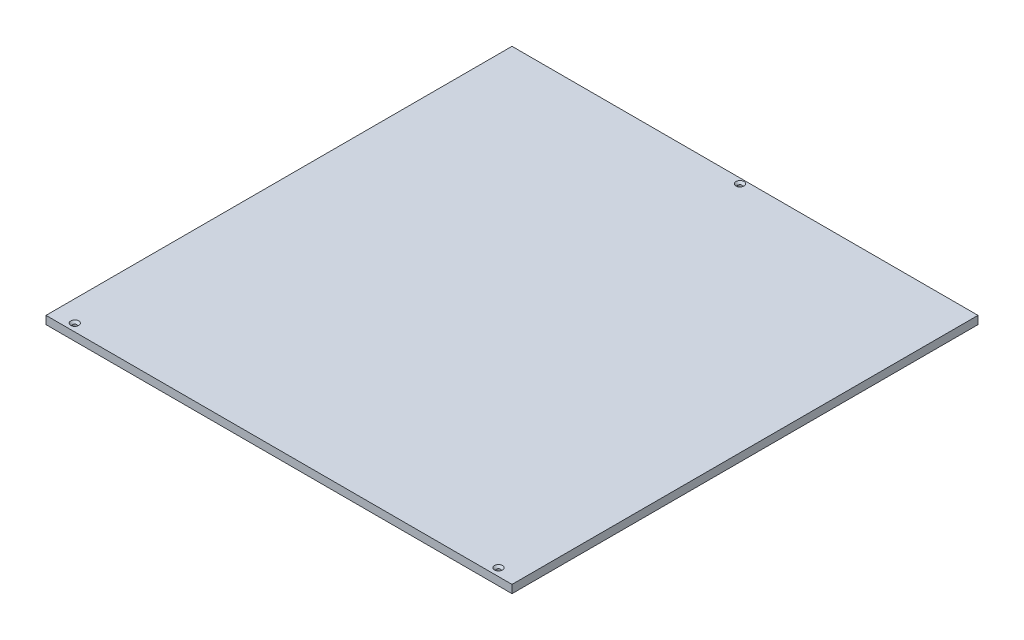
ISO-10303-21;
HEADER;
FILE_DESCRIPTION(('STEP AP214'),'2;1');
FILE_NAME('part.step','',(''),(''),'','','');
FILE_SCHEMA(('AUTOMOTIVE_DESIGN { 1 0 10303 214 1 1 1 1 }'));
ENDSEC;
DATA;
#1=APPLICATION_CONTEXT('core data for automotive mechanical design processes');
#2=APPLICATION_PROTOCOL_DEFINITION('international standard','automotive_design',2000,#1);
#3=PRODUCT_CONTEXT('',#1,'mechanical');
#4=PRODUCT('Part','Part','',(#3));
#5=PRODUCT_RELATED_PRODUCT_CATEGORY('part','',(#4));
#6=PRODUCT_DEFINITION_FORMATION('','',#4);
#7=PRODUCT_DEFINITION_CONTEXT('part definition',#1,'design');
#8=PRODUCT_DEFINITION('design','',#6,#7);
#9=PRODUCT_DEFINITION_SHAPE('','',#8);
#10=(LENGTH_UNIT() NAMED_UNIT(*) SI_UNIT(.MILLI.,.METRE.));
#11=(NAMED_UNIT(*) PLANE_ANGLE_UNIT() SI_UNIT($,.RADIAN.));
#12=(NAMED_UNIT(*) SI_UNIT($,.STERADIAN.) SOLID_ANGLE_UNIT());
#13=UNCERTAINTY_MEASURE_WITH_UNIT(LENGTH_MEASURE(1.E-05),#10,'distance_accuracy_value','');
#14=(GEOMETRIC_REPRESENTATION_CONTEXT(3) GLOBAL_UNCERTAINTY_ASSIGNED_CONTEXT((#13)) GLOBAL_UNIT_ASSIGNED_CONTEXT((#10,
#11,#12)) REPRESENTATION_CONTEXT('',''));
#15=CARTESIAN_POINT('',(0.,0.,0.));
#16=DIRECTION('',(0.,0.,1.));
#17=DIRECTION('',(1.,0.,0.));
#18=AXIS2_PLACEMENT_3D('',#15,#16,#17);
#19=CARTESIAN_POINT('',(0.,9.525,275.));
#20=DIRECTION('',(0.,0.,-1.));
#21=DIRECTION('',(-1.,0.,0.));
#22=AXIS2_PLACEMENT_3D('',#19,#20,#21);
#23=PLANE('',#22);
#24=DIRECTION('',(1.,0.,0.));
#25=VECTOR('',#24,1.);
#26=CARTESIAN_POINT('',(0.,0.,275.));
#27=LINE('',#26,#25);
#28=CARTESIAN_POINT('',(-275.,0.,275.));
#29=VERTEX_POINT('',#28);
#30=CARTESIAN_POINT('',(275.,0.,275.));
#31=VERTEX_POINT('',#30);
#32=EDGE_CURVE('E117',#29,#31,#27,.T.);
#33=ORIENTED_EDGE('',*,*,#32,.T.);
#34=DIRECTION('',(0.,-1.,0.));
#35=VECTOR('',#34,1.);
#36=CARTESIAN_POINT('',(275.,9.525,275.));
#37=LINE('',#36,#35);
#38=CARTESIAN_POINT('',(275.,9.525,275.));
#39=VERTEX_POINT('',#38);
#40=EDGE_CURVE('E11',#39,#31,#37,.T.);
#41=ORIENTED_EDGE('',*,*,#40,.F.);
#42=DIRECTION('',(1.,0.,0.));
#43=VECTOR('',#42,1.);
#44=CARTESIAN_POINT('',(0.,9.525,275.));
#45=LINE('',#44,#43);
#46=CARTESIAN_POINT('',(-275.,9.525,275.));
#47=VERTEX_POINT('',#46);
#48=EDGE_CURVE('E98',#47,#39,#45,.T.);
#49=ORIENTED_EDGE('',*,*,#48,.F.);
#50=DIRECTION('',(0.,-1.,0.));
#51=VECTOR('',#50,1.);
#52=CARTESIAN_POINT('',(-275.,9.525,275.));
#53=LINE('',#52,#51);
#54=EDGE_CURVE('E63',#47,#29,#53,.T.);
#55=ORIENTED_EDGE('',*,*,#54,.T.);
#56=EDGE_LOOP('',(#33,#41,#49,#55));
#57=FACE_BOUND('',#56,.T.);
#58=ADVANCED_FACE('F42',(#57),#23,.F.);
#59=CARTESIAN_POINT('',(275.,9.525,0.));
#60=DIRECTION('',(-1.,0.,0.));
#61=DIRECTION('',(0.,0.,1.));
#62=AXIS2_PLACEMENT_3D('',#59,#60,#61);
#63=PLANE('',#62);
#64=DIRECTION('',(0.,0.,-1.));
#65=VECTOR('',#64,1.);
#66=CARTESIAN_POINT('',(275.,0.,0.));
#67=LINE('',#66,#65);
#68=CARTESIAN_POINT('',(275.,0.,-275.));
#69=VERTEX_POINT('',#68);
#70=EDGE_CURVE('E104',#31,#69,#67,.T.);
#71=ORIENTED_EDGE('',*,*,#70,.T.);
#72=DIRECTION('',(0.,-1.,0.));
#73=VECTOR('',#72,1.);
#74=CARTESIAN_POINT('',(275.,9.525,-275.));
#75=LINE('',#74,#73);
#76=CARTESIAN_POINT('',(275.,9.525,-275.));
#77=VERTEX_POINT('',#76);
#78=EDGE_CURVE('E52',#77,#69,#75,.T.);
#79=ORIENTED_EDGE('',*,*,#78,.F.);
#80=DIRECTION('',(0.,0.,-1.));
#81=VECTOR('',#80,1.);
#82=CARTESIAN_POINT('',(275.,9.525,0.));
#83=LINE('',#82,#81);
#84=EDGE_CURVE('E90',#39,#77,#83,.T.);
#85=ORIENTED_EDGE('',*,*,#84,.F.);
#86=ORIENTED_EDGE('',*,*,#40,.T.);
#87=EDGE_LOOP('',(#71,#79,#85,#86));
#88=FACE_BOUND('',#87,.T.);
#89=ADVANCED_FACE('F103',(#88),#63,.F.);
#90=CARTESIAN_POINT('',(0.,9.525,-275.));
#91=DIRECTION('',(0.,0.,-1.));
#92=DIRECTION('',(-1.,0.,0.));
#93=AXIS2_PLACEMENT_3D('',#90,#91,#92);
#94=PLANE('',#93);
#95=DIRECTION('',(1.,0.,0.));
#96=VECTOR('',#95,1.);
#97=CARTESIAN_POINT('',(0.,0.,-275.));
#98=LINE('',#97,#96);
#99=CARTESIAN_POINT('',(-275.,0.,-275.));
#100=VERTEX_POINT('',#99);
#101=EDGE_CURVE('E123',#100,#69,#98,.T.);
#102=ORIENTED_EDGE('',*,*,#101,.F.);
#103=DIRECTION('',(0.,-1.,0.));
#104=VECTOR('',#103,1.);
#105=CARTESIAN_POINT('',(-275.,9.525,-275.));
#106=LINE('',#105,#104);
#107=CARTESIAN_POINT('',(-275.,9.525,-275.));
#108=VERTEX_POINT('',#107);
#109=EDGE_CURVE('E78',#108,#100,#106,.T.);
#110=ORIENTED_EDGE('',*,*,#109,.F.);
#111=DIRECTION('',(1.,0.,0.));
#112=VECTOR('',#111,1.);
#113=CARTESIAN_POINT('',(0.,9.525,-275.));
#114=LINE('',#113,#112);
#115=EDGE_CURVE('E97',#108,#77,#114,.T.);
#116=ORIENTED_EDGE('',*,*,#115,.T.);
#117=ORIENTED_EDGE('',*,*,#78,.T.);
#118=EDGE_LOOP('',(#102,#110,#116,#117));
#119=FACE_BOUND('',#118,.T.);
#120=ADVANCED_FACE('F109',(#119),#94,.T.);
#121=CARTESIAN_POINT('',(-275.,9.525,0.));
#122=DIRECTION('',(-1.,0.,0.));
#123=DIRECTION('',(0.,0.,1.));
#124=AXIS2_PLACEMENT_3D('',#121,#122,#123);
#125=PLANE('',#124);
#126=DIRECTION('',(0.,0.,-1.));
#127=VECTOR('',#126,1.);
#128=CARTESIAN_POINT('',(-275.,0.,0.));
#129=LINE('',#128,#127);
#130=EDGE_CURVE('E126',#29,#100,#129,.T.);
#131=ORIENTED_EDGE('',*,*,#130,.F.);
#132=ORIENTED_EDGE('',*,*,#54,.F.);
#133=DIRECTION('',(0.,0.,-1.));
#134=VECTOR('',#133,1.);
#135=CARTESIAN_POINT('',(-275.,9.525,0.));
#136=LINE('',#135,#134);
#137=EDGE_CURVE('E111',#47,#108,#136,.T.);
#138=ORIENTED_EDGE('',*,*,#137,.T.);
#139=ORIENTED_EDGE('',*,*,#109,.T.);
#140=EDGE_LOOP('',(#131,#132,#138,#139));
#141=FACE_BOUND('',#140,.T.);
#142=ADVANCED_FACE('F175',(#141),#125,.T.);
#143=CARTESIAN_POINT('',(0.,9.525,0.));
#144=DIRECTION('',(0.,1.,0.));
#145=DIRECTION('',(0.,0.,1.));
#146=AXIS2_PLACEMENT_3D('',#143,#144,#145);
#147=PLANE('',#146);
#148=CARTESIAN_POINT('',(0.,9.525,-268.997567297408));
#149=DIRECTION('',(0.,1.,0.));
#150=DIRECTION('',(0.,0.,1.));
#151=AXIS2_PLACEMENT_3D('',#148,#149,#150);
#152=CIRCLE('',#151,4.7);
#153=CARTESIAN_POINT('',(0.,9.525,-264.297567297408));
#154=VERTEX_POINT('',#153);
#155=EDGE_CURVE('E307',#154,#154,#152,.T.);
#156=ORIENTED_EDGE('',*,*,#155,.F.);
#157=EDGE_LOOP('',(#156));
#158=FACE_BOUND('',#157,.T.);
#159=CARTESIAN_POINT('',(250.,9.525,266.));
#160=DIRECTION('',(0.,1.,0.));
#161=DIRECTION('',(0.,0.,1.));
#162=AXIS2_PLACEMENT_3D('',#159,#160,#161);
#163=CIRCLE('',#162,4.69999999999998);
#164=CARTESIAN_POINT('',(250.,9.525,270.7));
#165=VERTEX_POINT('',#164);
#166=EDGE_CURVE('E149',#165,#165,#163,.T.);
#167=ORIENTED_EDGE('',*,*,#166,.F.);
#168=EDGE_LOOP('',(#167));
#169=FACE_BOUND('',#168,.T.);
#170=CARTESIAN_POINT('',(-250.,9.525,266.));
#171=DIRECTION('',(0.,1.,0.));
#172=DIRECTION('',(0.,0.,1.));
#173=AXIS2_PLACEMENT_3D('',#170,#171,#172);
#174=CIRCLE('',#173,4.70000000000001);
#175=CARTESIAN_POINT('',(-250.,9.525,270.7));
#176=VERTEX_POINT('',#175);
#177=EDGE_CURVE('E140',#176,#176,#174,.T.);
#178=ORIENTED_EDGE('',*,*,#177,.F.);
#179=EDGE_LOOP('',(#178));
#180=FACE_BOUND('',#179,.T.);
#181=ORIENTED_EDGE('',*,*,#48,.T.);
#182=ORIENTED_EDGE('',*,*,#84,.T.);
#183=ORIENTED_EDGE('',*,*,#115,.F.);
#184=ORIENTED_EDGE('',*,*,#137,.F.);
#185=EDGE_LOOP('',(#181,#182,#183,#184));
#186=FACE_BOUND('',#185,.T.);
#187=ADVANCED_FACE('F94',(#158,#169,#180,#186),#147,.T.);
#188=CARTESIAN_POINT('',(0.,0.,0.));
#189=DIRECTION('',(0.,1.,0.));
#190=DIRECTION('',(0.,0.,1.));
#191=AXIS2_PLACEMENT_3D('',#188,#189,#190);
#192=PLANE('',#191);
#193=CARTESIAN_POINT('',(0.,0.,-268.997567297408));
#194=DIRECTION('',(0.,1.,0.));
#195=DIRECTION('',(0.,0.,1.));
#196=AXIS2_PLACEMENT_3D('',#193,#194,#195);
#197=CIRCLE('',#196,2.25);
#198=CARTESIAN_POINT('',(0.,0.,-266.747567297408));
#199=VERTEX_POINT('',#198);
#200=EDGE_CURVE('E45',#199,#199,#197,.T.);
#201=ORIENTED_EDGE('',*,*,#200,.T.);
#202=EDGE_LOOP('',(#201));
#203=FACE_BOUND('',#202,.T.);
#204=CARTESIAN_POINT('',(250.,0.,266.));
#205=DIRECTION('',(0.,1.,0.));
#206=DIRECTION('',(0.,0.,1.));
#207=AXIS2_PLACEMENT_3D('',#204,#205,#206);
#208=CIRCLE('',#207,2.24999999999997);
#209=CARTESIAN_POINT('',(250.,0.,268.25));
#210=VERTEX_POINT('',#209);
#211=EDGE_CURVE('E137',#210,#210,#208,.T.);
#212=ORIENTED_EDGE('',*,*,#211,.T.);
#213=EDGE_LOOP('',(#212));
#214=FACE_BOUND('',#213,.T.);
#215=CARTESIAN_POINT('',(-250.,0.,266.));
#216=DIRECTION('',(0.,1.,0.));
#217=DIRECTION('',(0.,0.,1.));
#218=AXIS2_PLACEMENT_3D('',#215,#216,#217);
#219=CIRCLE('',#218,2.25);
#220=CARTESIAN_POINT('',(-250.,0.,268.25));
#221=VERTEX_POINT('',#220);
#222=EDGE_CURVE('E120',#221,#221,#219,.T.);
#223=ORIENTED_EDGE('',*,*,#222,.T.);
#224=EDGE_LOOP('',(#223));
#225=FACE_BOUND('',#224,.T.);
#226=ORIENTED_EDGE('',*,*,#32,.F.);
#227=ORIENTED_EDGE('',*,*,#130,.T.);
#228=ORIENTED_EDGE('',*,*,#101,.T.);
#229=ORIENTED_EDGE('',*,*,#70,.F.);
#230=EDGE_LOOP('',(#226,#227,#228,#229));
#231=FACE_BOUND('',#230,.T.);
#232=ADVANCED_FACE('F174',(#203,#214,#225,#231),#192,.F.);
#233=CARTESIAN_POINT('',(-250.,9.525,266.));
#234=DIRECTION('',(0.,1.,0.));
#235=DIRECTION('',(0.,0.,1.));
#236=AXIS2_PLACEMENT_3D('',#233,#234,#235);
#237=CYLINDRICAL_SURFACE('',#236,2.25);
#238=CARTESIAN_POINT('',(-250.,7.075,266.));
#239=DIRECTION('',(0.,1.,0.));
#240=DIRECTION('',(0.,0.,1.));
#241=AXIS2_PLACEMENT_3D('',#238,#239,#240);
#242=CIRCLE('',#241,2.25);
#243=CARTESIAN_POINT('',(-250.,7.075,268.25));
#244=VERTEX_POINT('',#243);
#245=EDGE_CURVE('E136',#244,#244,#242,.T.);
#246=ORIENTED_EDGE('',*,*,#245,.T.);
#247=EDGE_LOOP('',(#246));
#248=FACE_BOUND('',#247,.T.);
#249=ORIENTED_EDGE('',*,*,#222,.F.);
#250=EDGE_LOOP('',(#249));
#251=FACE_BOUND('',#250,.T.);
#252=ADVANCED_FACE('F163',(#248,#251),#237,.F.);
#253=CARTESIAN_POINT('',(-250.,9.525,266.));
#254=DIRECTION('',(0.,1.,0.));
#255=DIRECTION('',(0.,0.,1.));
#256=AXIS2_PLACEMENT_3D('',#253,#254,#255);
#257=CONICAL_SURFACE('',#256,4.70000000000001,0.78539816339745);
#258=ORIENTED_EDGE('',*,*,#245,.F.);
#259=EDGE_LOOP('',(#258));
#260=FACE_BOUND('',#259,.T.);
#261=ORIENTED_EDGE('',*,*,#177,.T.);
#262=EDGE_LOOP('',(#261));
#263=FACE_BOUND('',#262,.T.);
#264=ADVANCED_FACE('F166',(#260,#263),#257,.F.);
#265=CARTESIAN_POINT('',(250.,9.525,266.));
#266=DIRECTION('',(0.,1.,0.));
#267=DIRECTION('',(0.,0.,1.));
#268=AXIS2_PLACEMENT_3D('',#265,#266,#267);
#269=CYLINDRICAL_SURFACE('',#268,2.24999999999997);
#270=CARTESIAN_POINT('',(250.,7.075,266.));
#271=DIRECTION('',(0.,1.,0.));
#272=DIRECTION('',(0.,0.,1.));
#273=AXIS2_PLACEMENT_3D('',#270,#271,#272);
#274=CIRCLE('',#273,2.24999999999997);
#275=CARTESIAN_POINT('',(250.,7.075,268.25));
#276=VERTEX_POINT('',#275);
#277=EDGE_CURVE('E141',#276,#276,#274,.T.);
#278=ORIENTED_EDGE('',*,*,#277,.T.);
#279=EDGE_LOOP('',(#278));
#280=FACE_BOUND('',#279,.T.);
#281=ORIENTED_EDGE('',*,*,#211,.F.);
#282=EDGE_LOOP('',(#281));
#283=FACE_BOUND('',#282,.T.);
#284=ADVANCED_FACE('F169',(#280,#283),#269,.F.);
#285=CARTESIAN_POINT('',(250.,9.525,266.));
#286=DIRECTION('',(0.,1.,0.));
#287=DIRECTION('',(0.,0.,1.));
#288=AXIS2_PLACEMENT_3D('',#285,#286,#287);
#289=CONICAL_SURFACE('',#288,4.69999999999998,0.78539816339745);
#290=ORIENTED_EDGE('',*,*,#277,.F.);
#291=EDGE_LOOP('',(#290));
#292=FACE_BOUND('',#291,.T.);
#293=ORIENTED_EDGE('',*,*,#166,.T.);
#294=EDGE_LOOP('',(#293));
#295=FACE_BOUND('',#294,.T.);
#296=ADVANCED_FACE('F228',(#292,#295),#289,.F.);
#297=CARTESIAN_POINT('',(0.,9.525,-268.997567297408));
#298=DIRECTION('',(0.,1.,0.));
#299=DIRECTION('',(0.,0.,1.));
#300=AXIS2_PLACEMENT_3D('',#297,#298,#299);
#301=CYLINDRICAL_SURFACE('',#300,2.25);
#302=CARTESIAN_POINT('',(0.,7.075,-268.997567297408));
#303=DIRECTION('',(0.,1.,0.));
#304=DIRECTION('',(0.,0.,1.));
#305=AXIS2_PLACEMENT_3D('',#302,#303,#304);
#306=CIRCLE('',#305,2.25);
#307=CARTESIAN_POINT('',(0.,7.075,-266.747567297408));
#308=VERTEX_POINT('',#307);
#309=EDGE_CURVE('E305',#308,#308,#306,.T.);
#310=ORIENTED_EDGE('',*,*,#309,.T.);
#311=EDGE_LOOP('',(#310));
#312=FACE_BOUND('',#311,.T.);
#313=ORIENTED_EDGE('',*,*,#200,.F.);
#314=EDGE_LOOP('',(#313));
#315=FACE_BOUND('',#314,.T.);
#316=ADVANCED_FACE('F236',(#312,#315),#301,.F.);
#317=CARTESIAN_POINT('',(0.,9.525,-268.997567297408));
#318=DIRECTION('',(0.,1.,0.));
#319=DIRECTION('',(0.,0.,1.));
#320=AXIS2_PLACEMENT_3D('',#317,#318,#319);
#321=CONICAL_SURFACE('',#320,4.7,0.785398163397448);
#322=ORIENTED_EDGE('',*,*,#309,.F.);
#323=EDGE_LOOP('',(#322));
#324=FACE_BOUND('',#323,.T.);
#325=ORIENTED_EDGE('',*,*,#155,.T.);
#326=EDGE_LOOP('',(#325));
#327=FACE_BOUND('',#326,.T.);
#328=ADVANCED_FACE('F245',(#324,#327),#321,.F.);
#329=CLOSED_SHELL('',(#58,#89,#120,#142,#187,#232,#252,#264,#284,#296,#316,#328));
#330=MANIFOLD_SOLID_BREP('B2',#329);
#331=ADVANCED_BREP_SHAPE_REPRESENTATION('',(#18,#330),#14);
#332=SHAPE_DEFINITION_REPRESENTATION(#9,#331);
ENDSEC;
END-ISO-10303-21;
